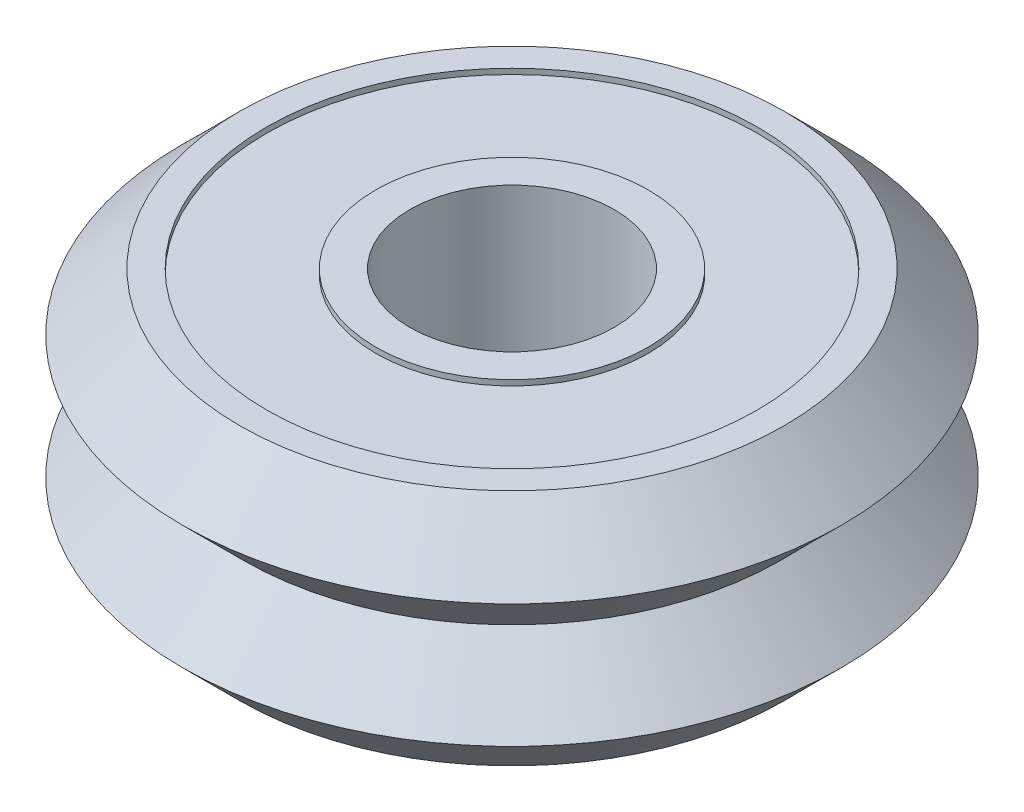
ISO-10303-21;
HEADER;
FILE_DESCRIPTION(('STEP AP214'),'2;1');
FILE_NAME('part.step','',(''),(''),'','','');
FILE_SCHEMA(('AUTOMOTIVE_DESIGN { 1 0 10303 214 1 1 1 1 }'));
ENDSEC;
DATA;
#1=APPLICATION_CONTEXT('core data for automotive mechanical design processes');
#2=APPLICATION_PROTOCOL_DEFINITION('international standard','automotive_design',2000,#1);
#3=PRODUCT_CONTEXT('',#1,'mechanical');
#4=PRODUCT('Part','Part','',(#3));
#5=PRODUCT_RELATED_PRODUCT_CATEGORY('part','',(#4));
#6=PRODUCT_DEFINITION_FORMATION('','',#4);
#7=PRODUCT_DEFINITION_CONTEXT('part definition',#1,'design');
#8=PRODUCT_DEFINITION('design','',#6,#7);
#9=PRODUCT_DEFINITION_SHAPE('','',#8);
#10=(LENGTH_UNIT() NAMED_UNIT(*) SI_UNIT(.MILLI.,.METRE.));
#11=(NAMED_UNIT(*) PLANE_ANGLE_UNIT() SI_UNIT($,.RADIAN.));
#12=(NAMED_UNIT(*) SI_UNIT($,.STERADIAN.) SOLID_ANGLE_UNIT());
#13=UNCERTAINTY_MEASURE_WITH_UNIT(LENGTH_MEASURE(1.E-05),#10,'distance_accuracy_value','');
#14=(GEOMETRIC_REPRESENTATION_CONTEXT(3) GLOBAL_UNCERTAINTY_ASSIGNED_CONTEXT((#13)) GLOBAL_UNIT_ASSIGNED_CONTEXT((#10,
#11,#12)) REPRESENTATION_CONTEXT('',''));
#15=CARTESIAN_POINT('',(0.,0.,0.));
#16=DIRECTION('',(0.,0.,1.));
#17=DIRECTION('',(1.,0.,0.));
#18=AXIS2_PLACEMENT_3D('',#15,#16,#17);
#19=CARTESIAN_POINT('',(4.7625,5.55,0.));
#20=DIRECTION('',(0.,-1.,0.));
#21=DIRECTION('',(0.,0.,-1.));
#22=AXIS2_PLACEMENT_3D('',#19,#20,#21);
#23=PLANE('',#22);
#24=CARTESIAN_POINT('',(0.,5.55,0.));
#25=DIRECTION('',(0.,-1.,0.));
#26=DIRECTION('',(0.,0.,-1.));
#27=AXIS2_PLACEMENT_3D('',#24,#25,#26);
#28=CIRCLE('',#27,12.69);
#29=CARTESIAN_POINT('',(0.,5.55,-12.69));
#30=VERTEX_POINT('',#29);
#31=EDGE_CURVE('E56',#30,#30,#28,.T.);
#32=ORIENTED_EDGE('',*,*,#31,.F.);
#33=EDGE_LOOP('',(#32));
#34=FACE_BOUND('',#33,.T.);
#35=CARTESIAN_POINT('',(0.,5.55,0.));
#36=DIRECTION('',(0.,1.,0.));
#37=DIRECTION('',(0.,0.,1.));
#38=AXIS2_PLACEMENT_3D('',#35,#36,#37);
#39=CIRCLE('',#38,11.43);
#40=CARTESIAN_POINT('',(0.,5.55,11.43));
#41=VERTEX_POINT('',#40);
#42=EDGE_CURVE('E17',#41,#41,#39,.F.);
#43=ORIENTED_EDGE('',*,*,#42,.T.);
#44=EDGE_LOOP('',(#43));
#45=FACE_BOUND('',#44,.T.);
#46=ADVANCED_FACE('F14',(#34,#45),#23,.F.);
#47=CARTESIAN_POINT('',(0.,5.296,0.));
#48=DIRECTION('',(0.,1.,0.));
#49=DIRECTION('',(0.,0.,1.));
#50=AXIS2_PLACEMENT_3D('',#47,#48,#49);
#51=CYLINDRICAL_SURFACE('',#50,11.43);
#52=ORIENTED_EDGE('',*,*,#42,.F.);
#53=EDGE_LOOP('',(#52));
#54=FACE_BOUND('',#53,.T.);
#55=CARTESIAN_POINT('',(0.,5.296,0.));
#56=DIRECTION('',(0.,1.,0.));
#57=DIRECTION('',(0.,0.,1.));
#58=AXIS2_PLACEMENT_3D('',#55,#56,#57);
#59=CIRCLE('',#58,11.43);
#60=CARTESIAN_POINT('',(0.,5.296,11.43));
#61=VERTEX_POINT('',#60);
#62=EDGE_CURVE('E54',#61,#61,#59,.T.);
#63=ORIENTED_EDGE('',*,*,#62,.F.);
#64=EDGE_LOOP('',(#63));
#65=FACE_BOUND('',#64,.T.);
#66=ADVANCED_FACE('F64',(#54,#65),#51,.F.);
#67=CARTESIAN_POINT('',(0.,2.875,0.));
#68=DIRECTION('',(0.,-1.,0.));
#69=DIRECTION('',(0.,0.,-1.));
#70=AXIS2_PLACEMENT_3D('',#67,#68,#69);
#71=CONICAL_SURFACE('',#70,15.365,0.785398163397449);
#72=CARTESIAN_POINT('',(0.,2.875,0.));
#73=DIRECTION('',(0.,1.,0.));
#74=DIRECTION('',(0.,0.,1.));
#75=AXIS2_PLACEMENT_3D('',#72,#73,#74);
#76=CIRCLE('',#75,15.365);
#77=CARTESIAN_POINT('',(0.,2.875,15.365));
#78=VERTEX_POINT('',#77);
#79=EDGE_CURVE('E29',#78,#78,#76,.F.);
#80=ORIENTED_EDGE('',*,*,#79,.F.);
#81=EDGE_LOOP('',(#80));
#82=FACE_BOUND('',#81,.T.);
#83=ORIENTED_EDGE('',*,*,#31,.T.);
#84=EDGE_LOOP('',(#83));
#85=FACE_BOUND('',#84,.T.);
#86=ADVANCED_FACE('F67',(#82,#85),#71,.T.);
#87=CARTESIAN_POINT('',(0.,5.296,0.));
#88=DIRECTION('',(0.,1.,0.));
#89=DIRECTION('',(0.,0.,1.));
#90=AXIS2_PLACEMENT_3D('',#87,#88,#89);
#91=PLANE('',#90);
#92=ORIENTED_EDGE('',*,*,#62,.T.);
#93=EDGE_LOOP('',(#92));
#94=FACE_BOUND('',#93,.T.);
#95=CARTESIAN_POINT('',(0.,5.296,0.));
#96=DIRECTION('',(0.,1.,0.));
#97=DIRECTION('',(0.,0.,1.));
#98=AXIS2_PLACEMENT_3D('',#95,#96,#97);
#99=CIRCLE('',#98,6.35);
#100=CARTESIAN_POINT('',(0.,5.296,6.35));
#101=VERTEX_POINT('',#100);
#102=EDGE_CURVE('E51',#101,#101,#99,.T.);
#103=ORIENTED_EDGE('',*,*,#102,.F.);
#104=EDGE_LOOP('',(#103));
#105=FACE_BOUND('',#104,.T.);
#106=ADVANCED_FACE('F70',(#94,#105),#91,.T.);
#107=CARTESIAN_POINT('',(0.,2.875,0.));
#108=DIRECTION('',(0.,1.,0.));
#109=DIRECTION('',(-1.,0.,0.));
#110=AXIS2_PLACEMENT_3D('',#107,#108,#109);
#111=CONICAL_SURFACE('',#110,15.365,0.785398163397448);
#112=ORIENTED_EDGE('',*,*,#79,.T.);
#113=EDGE_LOOP('',(#112));
#114=FACE_BOUND('',#113,.T.);
#115=CARTESIAN_POINT('',(0.,0.,0.));
#116=DIRECTION('',(0.,-1.,0.));
#117=DIRECTION('',(0.,0.,-1.));
#118=AXIS2_PLACEMENT_3D('',#115,#116,#117);
#119=CIRCLE('',#118,12.49);
#120=CARTESIAN_POINT('',(0.,0.,-12.49));
#121=VERTEX_POINT('',#120);
#122=EDGE_CURVE('E50',#121,#121,#119,.T.);
#123=ORIENTED_EDGE('',*,*,#122,.F.);
#124=EDGE_LOOP('',(#123));
#125=FACE_BOUND('',#124,.T.);
#126=ADVANCED_FACE('F73',(#114,#125),#111,.T.);
#127=CARTESIAN_POINT('',(0.,5.296,0.));
#128=DIRECTION('',(0.,1.,0.));
#129=DIRECTION('',(0.,0.,1.));
#130=AXIS2_PLACEMENT_3D('',#127,#128,#129);
#131=CYLINDRICAL_SURFACE('',#130,6.35);
#132=CARTESIAN_POINT('',(0.,5.55,0.));
#133=DIRECTION('',(0.,1.,0.));
#134=DIRECTION('',(0.,0.,1.));
#135=AXIS2_PLACEMENT_3D('',#132,#133,#134);
#136=CIRCLE('',#135,6.35);
#137=CARTESIAN_POINT('',(0.,5.55,6.35));
#138=VERTEX_POINT('',#137);
#139=EDGE_CURVE('E47',#138,#138,#136,.F.);
#140=ORIENTED_EDGE('',*,*,#139,.T.);
#141=EDGE_LOOP('',(#140));
#142=FACE_BOUND('',#141,.T.);
#143=ORIENTED_EDGE('',*,*,#102,.T.);
#144=EDGE_LOOP('',(#143));
#145=FACE_BOUND('',#144,.T.);
#146=ADVANCED_FACE('F77',(#142,#145),#131,.T.);
#147=CARTESIAN_POINT('',(0.,-2.875,0.));
#148=DIRECTION('',(0.,-1.,0.));
#149=DIRECTION('',(1.,0.,0.));
#150=AXIS2_PLACEMENT_3D('',#147,#148,#149);
#151=CONICAL_SURFACE('',#150,15.365,0.785398163397448);
#152=CARTESIAN_POINT('',(0.,-2.875,0.));
#153=DIRECTION('',(0.,1.,0.));
#154=DIRECTION('',(0.,0.,1.));
#155=AXIS2_PLACEMENT_3D('',#152,#153,#154);
#156=CIRCLE('',#155,15.365);
#157=CARTESIAN_POINT('',(0.,-2.875,15.365));
#158=VERTEX_POINT('',#157);
#159=EDGE_CURVE('E46',#158,#158,#156,.F.);
#160=ORIENTED_EDGE('',*,*,#159,.F.);
#161=EDGE_LOOP('',(#160));
#162=FACE_BOUND('',#161,.T.);
#163=ORIENTED_EDGE('',*,*,#122,.T.);
#164=EDGE_LOOP('',(#163));
#165=FACE_BOUND('',#164,.T.);
#166=ADVANCED_FACE('F79',(#162,#165),#151,.T.);
#167=CARTESIAN_POINT('',(4.7625,5.55,0.));
#168=DIRECTION('',(0.,-1.,0.));
#169=DIRECTION('',(0.,0.,-1.));
#170=AXIS2_PLACEMENT_3D('',#167,#168,#169);
#171=PLANE('',#170);
#172=ORIENTED_EDGE('',*,*,#139,.F.);
#173=EDGE_LOOP('',(#172));
#174=FACE_BOUND('',#173,.T.);
#175=CARTESIAN_POINT('',(0.,5.55,0.));
#176=DIRECTION('',(0.,1.,0.));
#177=DIRECTION('',(0.,0.,1.));
#178=AXIS2_PLACEMENT_3D('',#175,#176,#177);
#179=CIRCLE('',#178,4.7625);
#180=CARTESIAN_POINT('',(0.,5.55,4.7625));
#181=VERTEX_POINT('',#180);
#182=EDGE_CURVE('E43',#181,#181,#179,.F.);
#183=ORIENTED_EDGE('',*,*,#182,.T.);
#184=EDGE_LOOP('',(#183));
#185=FACE_BOUND('',#184,.T.);
#186=ADVANCED_FACE('F87',(#174,#185),#171,.F.);
#187=CARTESIAN_POINT('',(0.,-2.875,0.));
#188=DIRECTION('',(0.,1.,0.));
#189=DIRECTION('',(0.,0.,1.));
#190=AXIS2_PLACEMENT_3D('',#187,#188,#189);
#191=CONICAL_SURFACE('',#190,15.365,0.785398163397449);
#192=ORIENTED_EDGE('',*,*,#159,.T.);
#193=EDGE_LOOP('',(#192));
#194=FACE_BOUND('',#193,.T.);
#195=CARTESIAN_POINT('',(0.,-5.55,0.));
#196=DIRECTION('',(0.,1.,0.));
#197=DIRECTION('',(0.,0.,1.));
#198=AXIS2_PLACEMENT_3D('',#195,#196,#197);
#199=CIRCLE('',#198,12.69);
#200=CARTESIAN_POINT('',(0.,-5.55,12.69));
#201=VERTEX_POINT('',#200);
#202=EDGE_CURVE('E40',#201,#201,#199,.T.);
#203=ORIENTED_EDGE('',*,*,#202,.T.);
#204=EDGE_LOOP('',(#203));
#205=FACE_BOUND('',#204,.T.);
#206=ADVANCED_FACE('F118',(#194,#205),#191,.T.);
#207=CARTESIAN_POINT('',(0.,64.3897959183673,0.));
#208=DIRECTION('',(0.,1.,0.));
#209=DIRECTION('',(0.,0.,1.));
#210=AXIS2_PLACEMENT_3D('',#207,#208,#209);
#211=CYLINDRICAL_SURFACE('',#210,4.7625);
#212=CARTESIAN_POINT('',(0.,-5.55,0.));
#213=DIRECTION('',(0.,1.,0.));
#214=DIRECTION('',(0.,0.,1.));
#215=AXIS2_PLACEMENT_3D('',#212,#213,#214);
#216=CIRCLE('',#215,4.7625);
#217=CARTESIAN_POINT('',(0.,-5.55,4.7625));
#218=VERTEX_POINT('',#217);
#219=EDGE_CURVE('E37',#218,#218,#216,.F.);
#220=ORIENTED_EDGE('',*,*,#219,.T.);
#221=EDGE_LOOP('',(#220));
#222=FACE_BOUND('',#221,.T.);
#223=ORIENTED_EDGE('',*,*,#182,.F.);
#224=EDGE_LOOP('',(#223));
#225=FACE_BOUND('',#224,.T.);
#226=ADVANCED_FACE('F114',(#222,#225),#211,.F.);
#227=CARTESIAN_POINT('',(12.69,-5.55,0.));
#228=DIRECTION('',(0.,1.,0.));
#229=DIRECTION('',(0.,0.,1.));
#230=AXIS2_PLACEMENT_3D('',#227,#228,#229);
#231=PLANE('',#230);
#232=CARTESIAN_POINT('',(0.,-5.55,0.));
#233=DIRECTION('',(0.,-1.,0.));
#234=DIRECTION('',(0.,0.,-1.));
#235=AXIS2_PLACEMENT_3D('',#232,#233,#234);
#236=CIRCLE('',#235,11.43);
#237=CARTESIAN_POINT('',(0.,-5.55,-11.43));
#238=VERTEX_POINT('',#237);
#239=EDGE_CURVE('E34',#238,#238,#236,.F.);
#240=ORIENTED_EDGE('',*,*,#239,.T.);
#241=EDGE_LOOP('',(#240));
#242=FACE_BOUND('',#241,.T.);
#243=ORIENTED_EDGE('',*,*,#202,.F.);
#244=EDGE_LOOP('',(#243));
#245=FACE_BOUND('',#244,.T.);
#246=ADVANCED_FACE('F110',(#242,#245),#231,.F.);
#247=CARTESIAN_POINT('',(12.69,-5.55,0.));
#248=DIRECTION('',(0.,1.,0.));
#249=DIRECTION('',(0.,0.,1.));
#250=AXIS2_PLACEMENT_3D('',#247,#248,#249);
#251=PLANE('',#250);
#252=ORIENTED_EDGE('',*,*,#219,.F.);
#253=EDGE_LOOP('',(#252));
#254=FACE_BOUND('',#253,.T.);
#255=CARTESIAN_POINT('',(0.,-5.55,0.));
#256=DIRECTION('',(0.,-1.,0.));
#257=DIRECTION('',(0.,0.,-1.));
#258=AXIS2_PLACEMENT_3D('',#255,#256,#257);
#259=CIRCLE('',#258,6.35);
#260=CARTESIAN_POINT('',(0.,-5.55,-6.35));
#261=VERTEX_POINT('',#260);
#262=EDGE_CURVE('E26',#261,#261,#259,.F.);
#263=ORIENTED_EDGE('',*,*,#262,.F.);
#264=EDGE_LOOP('',(#263));
#265=FACE_BOUND('',#264,.T.);
#266=ADVANCED_FACE('F106',(#254,#265),#251,.F.);
#267=CARTESIAN_POINT('',(0.,-5.296,0.));
#268=DIRECTION('',(0.,-1.,0.));
#269=DIRECTION('',(0.,0.,-1.));
#270=AXIS2_PLACEMENT_3D('',#267,#268,#269);
#271=CYLINDRICAL_SURFACE('',#270,11.43);
#272=CARTESIAN_POINT('',(0.,-5.296,0.));
#273=DIRECTION('',(0.,-1.,0.));
#274=DIRECTION('',(0.,0.,-1.));
#275=AXIS2_PLACEMENT_3D('',#272,#273,#274);
#276=CIRCLE('',#275,11.43);
#277=CARTESIAN_POINT('',(0.,-5.296,-11.43));
#278=VERTEX_POINT('',#277);
#279=EDGE_CURVE('E21',#278,#278,#276,.T.);
#280=ORIENTED_EDGE('',*,*,#279,.F.);
#281=EDGE_LOOP('',(#280));
#282=FACE_BOUND('',#281,.T.);
#283=ORIENTED_EDGE('',*,*,#239,.F.);
#284=EDGE_LOOP('',(#283));
#285=FACE_BOUND('',#284,.T.);
#286=ADVANCED_FACE('F99',(#282,#285),#271,.F.);
#287=CARTESIAN_POINT('',(0.,-5.296,0.));
#288=DIRECTION('',(0.,-1.,0.));
#289=DIRECTION('',(0.,0.,-1.));
#290=AXIS2_PLACEMENT_3D('',#287,#288,#289);
#291=CYLINDRICAL_SURFACE('',#290,6.35);
#292=ORIENTED_EDGE('',*,*,#262,.T.);
#293=EDGE_LOOP('',(#292));
#294=FACE_BOUND('',#293,.T.);
#295=CARTESIAN_POINT('',(0.,-5.296,0.));
#296=DIRECTION('',(0.,-1.,0.));
#297=DIRECTION('',(0.,0.,-1.));
#298=AXIS2_PLACEMENT_3D('',#295,#296,#297);
#299=CIRCLE('',#298,6.35);
#300=CARTESIAN_POINT('',(0.,-5.296,-6.35));
#301=VERTEX_POINT('',#300);
#302=EDGE_CURVE('E10',#301,#301,#299,.F.);
#303=ORIENTED_EDGE('',*,*,#302,.F.);
#304=EDGE_LOOP('',(#303));
#305=FACE_BOUND('',#304,.T.);
#306=ADVANCED_FACE('F94',(#294,#305),#291,.T.);
#307=CARTESIAN_POINT('',(0.,-5.296,0.));
#308=DIRECTION('',(0.,-1.,0.));
#309=DIRECTION('',(0.,0.,-1.));
#310=AXIS2_PLACEMENT_3D('',#307,#308,#309);
#311=PLANE('',#310);
#312=ORIENTED_EDGE('',*,*,#302,.T.);
#313=EDGE_LOOP('',(#312));
#314=FACE_BOUND('',#313,.T.);
#315=ORIENTED_EDGE('',*,*,#279,.T.);
#316=EDGE_LOOP('',(#315));
#317=FACE_BOUND('',#316,.T.);
#318=ADVANCED_FACE('F92',(#314,#317),#311,.T.);
#319=CLOSED_SHELL('',(#46,#66,#86,#106,#126,#146,#166,#186,#206,#226,#246,#266,#286,#306,#318));
#320=MANIFOLD_SOLID_BREP('B1',#319);
#321=ADVANCED_BREP_SHAPE_REPRESENTATION('',(#18,#320),#14);
#322=SHAPE_DEFINITION_REPRESENTATION(#9,#321);
ENDSEC;
END-ISO-10303-21;
